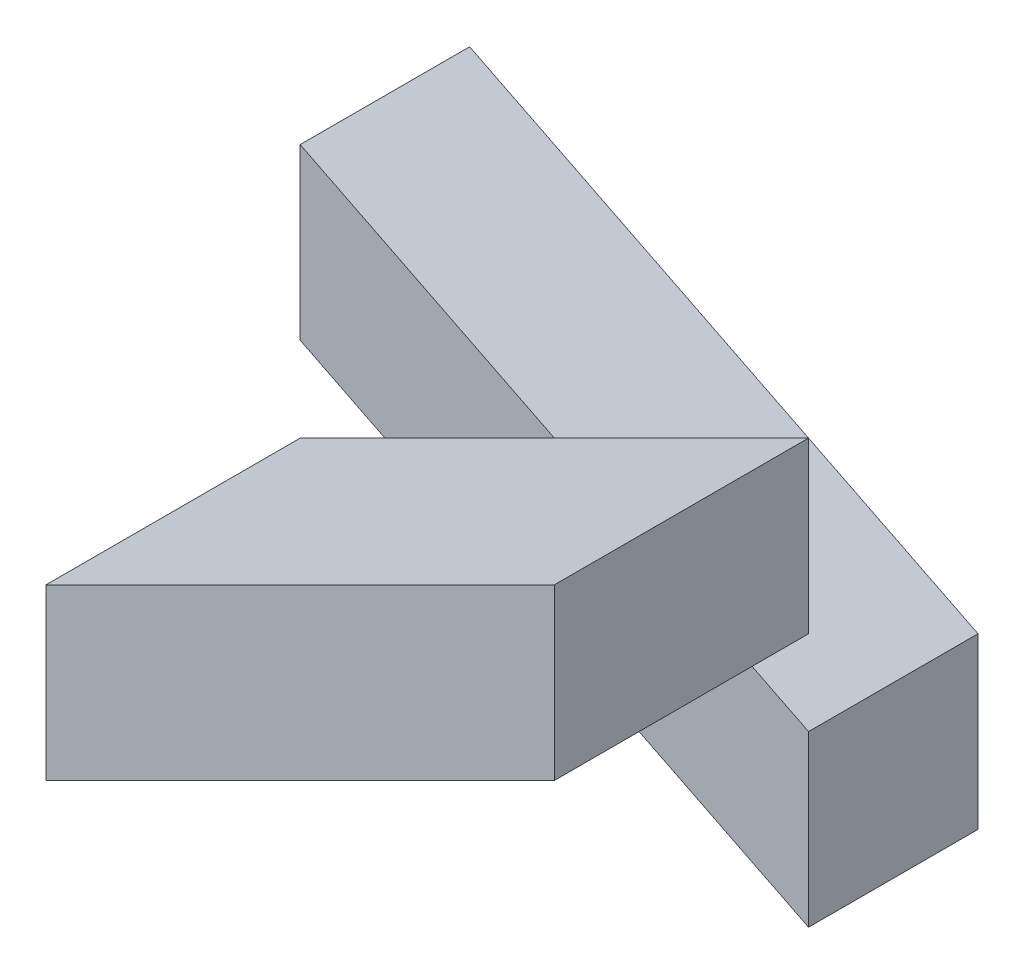
ISO-10303-21;
HEADER;
FILE_DESCRIPTION(('STEP AP214'),'2;1');
FILE_NAME('part.step','',(''),(''),'','','');
FILE_SCHEMA(('AUTOMOTIVE_DESIGN { 1 0 10303 214 1 1 1 1 }'));
ENDSEC;
DATA;
#1=APPLICATION_CONTEXT('core data for automotive mechanical design processes');
#2=APPLICATION_PROTOCOL_DEFINITION('international standard','automotive_design',2000,#1);
#3=PRODUCT_CONTEXT('',#1,'mechanical');
#4=PRODUCT('Part','Part','',(#3));
#5=PRODUCT_RELATED_PRODUCT_CATEGORY('part','',(#4));
#6=PRODUCT_DEFINITION_FORMATION('','',#4);
#7=PRODUCT_DEFINITION_CONTEXT('part definition',#1,'design');
#8=PRODUCT_DEFINITION('design','',#6,#7);
#9=PRODUCT_DEFINITION_SHAPE('','',#8);
#10=(LENGTH_UNIT() NAMED_UNIT(*) SI_UNIT(.MILLI.,.METRE.));
#11=(NAMED_UNIT(*) PLANE_ANGLE_UNIT() SI_UNIT($,.RADIAN.));
#12=(NAMED_UNIT(*) SI_UNIT($,.STERADIAN.) SOLID_ANGLE_UNIT());
#13=UNCERTAINTY_MEASURE_WITH_UNIT(LENGTH_MEASURE(1.E-05),#10,'distance_accuracy_value','');
#14=(GEOMETRIC_REPRESENTATION_CONTEXT(3) GLOBAL_UNCERTAINTY_ASSIGNED_CONTEXT((#13)) GLOBAL_UNIT_ASSIGNED_CONTEXT((#10,
#11,#12)) REPRESENTATION_CONTEXT('',''));
#15=CARTESIAN_POINT('',(0.,0.,0.));
#16=DIRECTION('',(0.,0.,1.));
#17=DIRECTION('',(1.,0.,0.));
#18=AXIS2_PLACEMENT_3D('',#15,#16,#17);
#19=CARTESIAN_POINT('',(0.,0.,10.));
#20=DIRECTION('',(0.,0.,1.));
#21=DIRECTION('',(1.,0.,0.));
#22=AXIS2_PLACEMENT_3D('',#19,#20,#21);
#23=PLANE('',#22);
#24=DIRECTION('',(-0.894427190999916,-0.447213595499958,0.));
#25=VECTOR('',#24,1.);
#26=CARTESIAN_POINT('',(-39.9082568807339,0.0917431192660537,10.));
#27=LINE('',#26,#25);
#28=CARTESIAN_POINT('',(-24.9082568807339,7.59174311926605,10.));
#29=VERTEX_POINT('',#28);
#30=CARTESIAN_POINT('',(-34.9082568807339,2.59174311926605,10.));
#31=VERTEX_POINT('',#30);
#32=EDGE_CURVE('E11',#29,#31,#27,.T.);
#33=ORIENTED_EDGE('',*,*,#32,.F.);
#34=DIRECTION('',(-0.894427190999916,0.447213595499958,0.));
#35=VECTOR('',#34,1.);
#36=CARTESIAN_POINT('',(-9.90825688073395,0.0917431192660537,10.));
#37=LINE('',#36,#35);
#38=CARTESIAN_POINT('',(-39.9082568807339,15.0917431192661,10.));
#39=VERTEX_POINT('',#38);
#40=EDGE_CURVE('E152',#29,#39,#37,.T.);
#41=ORIENTED_EDGE('',*,*,#40,.T.);
#42=DIRECTION('',(0.,-1.,0.));
#43=VECTOR('',#42,1.);
#44=CARTESIAN_POINT('',(-39.9082568807339,15.0917431192661,10.));
#45=LINE('',#44,#43);
#46=CARTESIAN_POINT('',(-39.9082568807339,5.09174311926605,10.));
#47=VERTEX_POINT('',#46);
#48=EDGE_CURVE('E150',#39,#47,#45,.T.);
#49=ORIENTED_EDGE('',*,*,#48,.T.);
#50=DIRECTION('',(0.894427190999916,-0.447213595499958,0.));
#51=VECTOR('',#50,1.);
#52=CARTESIAN_POINT('',(-39.9082568807339,5.09174311926605,10.));
#53=LINE('',#52,#51);
#54=EDGE_CURVE('E155',#47,#31,#53,.T.);
#55=ORIENTED_EDGE('',*,*,#54,.T.);
#56=EDGE_LOOP('',(#33,#41,#49,#55));
#57=FACE_BOUND('',#56,.T.);
#58=ADVANCED_FACE('F33',(#57),#23,.T.);
#59=CARTESIAN_POINT('',(-9.90825688073395,0.0917431192660537,10.));
#60=DIRECTION('',(-0.447213595499958,-0.894427190999916,0.));
#61=DIRECTION('',(0.894427190999916,-0.447213595499958,0.));
#62=AXIS2_PLACEMENT_3D('',#59,#60,#61);
#63=PLANE('',#62);
#64=DIRECTION('',(-0.894427190999916,0.447213595499958,0.));
#65=VECTOR('',#64,1.);
#66=CARTESIAN_POINT('',(-9.90825688073395,0.0917431192660537,0.));
#67=LINE('',#66,#65);
#68=CARTESIAN_POINT('',(-9.90825688073395,0.0917431192660537,0.));
#69=VERTEX_POINT('',#68);
#70=CARTESIAN_POINT('',(-39.9082568807339,15.0917431192661,0.));
#71=VERTEX_POINT('',#70);
#72=EDGE_CURVE('E139',#69,#71,#67,.T.);
#73=ORIENTED_EDGE('',*,*,#72,.T.);
#74=DIRECTION('',(0.,0.,-1.));
#75=VECTOR('',#74,1.);
#76=CARTESIAN_POINT('',(-39.9082568807339,15.0917431192661,10.));
#77=LINE('',#76,#75);
#78=EDGE_CURVE('E37',#39,#71,#77,.T.);
#79=ORIENTED_EDGE('',*,*,#78,.F.);
#80=ORIENTED_EDGE('',*,*,#40,.F.);
#81=CARTESIAN_POINT('',(-14.908256880734,2.59174311926606,10.));
#82=VERTEX_POINT('',#81);
#83=EDGE_CURVE('E151',#82,#29,#37,.T.);
#84=ORIENTED_EDGE('',*,*,#83,.F.);
#85=CARTESIAN_POINT('',(-9.90825688073395,0.0917431192660537,10.));
#86=VERTEX_POINT('',#85);
#87=EDGE_CURVE('E148',#86,#82,#37,.T.);
#88=ORIENTED_EDGE('',*,*,#87,.F.);
#89=DIRECTION('',(0.,0.,-1.));
#90=VECTOR('',#89,1.);
#91=CARTESIAN_POINT('',(-9.90825688073395,0.0917431192660537,10.));
#92=LINE('',#91,#90);
#93=EDGE_CURVE('E158',#86,#69,#92,.T.);
#94=ORIENTED_EDGE('',*,*,#93,.T.);
#95=EDGE_LOOP('',(#73,#79,#80,#84,#88,#94));
#96=FACE_BOUND('',#95,.T.);
#97=ADVANCED_FACE('F35',(#96),#63,.F.);
#98=CARTESIAN_POINT('',(-39.9082568807339,15.0917431192661,10.));
#99=DIRECTION('',(1.,0.,0.));
#100=DIRECTION('',(0.,1.,0.));
#101=AXIS2_PLACEMENT_3D('',#98,#99,#100);
#102=PLANE('',#101);
#103=DIRECTION('',(0.,-1.,0.));
#104=VECTOR('',#103,1.);
#105=CARTESIAN_POINT('',(-39.9082568807339,15.0917431192661,0.));
#106=LINE('',#105,#104);
#107=CARTESIAN_POINT('',(-39.9082568807339,5.09174311926605,0.));
#108=VERTEX_POINT('',#107);
#109=EDGE_CURVE('E142',#71,#108,#106,.T.);
#110=ORIENTED_EDGE('',*,*,#109,.T.);
#111=DIRECTION('',(0.,0.,-1.));
#112=VECTOR('',#111,1.);
#113=CARTESIAN_POINT('',(-39.9082568807339,5.09174311926605,10.));
#114=LINE('',#113,#112);
#115=EDGE_CURVE('E169',#47,#108,#114,.T.);
#116=ORIENTED_EDGE('',*,*,#115,.F.);
#117=ORIENTED_EDGE('',*,*,#48,.F.);
#118=ORIENTED_EDGE('',*,*,#78,.T.);
#119=EDGE_LOOP('',(#110,#116,#117,#118));
#120=FACE_BOUND('',#119,.T.);
#121=ADVANCED_FACE('F205',(#120),#102,.F.);
#122=CARTESIAN_POINT('',(-39.9082568807339,5.09174311926605,10.));
#123=DIRECTION('',(0.447213595499958,0.894427190999916,0.));
#124=DIRECTION('',(-0.894427190999916,0.447213595499958,0.));
#125=AXIS2_PLACEMENT_3D('',#122,#123,#124);
#126=PLANE('',#125);
#127=DIRECTION('',(0.894427190999916,-0.447213595499958,0.));
#128=VECTOR('',#127,1.);
#129=CARTESIAN_POINT('',(-39.9082568807339,5.09174311926605,0.));
#130=LINE('',#129,#128);
#131=CARTESIAN_POINT('',(-9.90825688073395,-9.90825688073395,0.));
#132=VERTEX_POINT('',#131);
#133=EDGE_CURVE('E161',#108,#132,#130,.T.);
#134=ORIENTED_EDGE('',*,*,#133,.T.);
#135=DIRECTION('',(0.,0.,-1.));
#136=VECTOR('',#135,1.);
#137=CARTESIAN_POINT('',(-9.90825688073395,-9.90825688073395,10.));
#138=LINE('',#137,#136);
#139=CARTESIAN_POINT('',(-9.90825688073395,-9.90825688073395,10.));
#140=VERTEX_POINT('',#139);
#141=EDGE_CURVE('E167',#140,#132,#138,.T.);
#142=ORIENTED_EDGE('',*,*,#141,.F.);
#143=CARTESIAN_POINT('',(-24.908256880734,-2.40825688073394,10.));
#144=VERTEX_POINT('',#143);
#145=EDGE_CURVE('E154',#144,#140,#53,.T.);
#146=ORIENTED_EDGE('',*,*,#145,.F.);
#147=EDGE_CURVE('E58',#31,#144,#53,.T.);
#148=ORIENTED_EDGE('',*,*,#147,.F.);
#149=ORIENTED_EDGE('',*,*,#54,.F.);
#150=ORIENTED_EDGE('',*,*,#115,.T.);
#151=EDGE_LOOP('',(#134,#142,#146,#148,#149,#150));
#152=FACE_BOUND('',#151,.T.);
#153=ADVANCED_FACE('F212',(#152),#126,.F.);
#154=CARTESIAN_POINT('',(-9.90825688073395,-9.90825688073395,10.));
#155=DIRECTION('',(-1.,0.,0.));
#156=DIRECTION('',(0.,0.,1.));
#157=AXIS2_PLACEMENT_3D('',#154,#155,#156);
#158=PLANE('',#157);
#159=DIRECTION('',(0.,1.,0.));
#160=VECTOR('',#159,1.);
#161=CARTESIAN_POINT('',(-9.90825688073395,-9.90825688073395,0.));
#162=LINE('',#161,#160);
#163=EDGE_CURVE('E163',#132,#69,#162,.T.);
#164=ORIENTED_EDGE('',*,*,#163,.T.);
#165=ORIENTED_EDGE('',*,*,#93,.F.);
#166=DIRECTION('',(0.,1.,0.));
#167=VECTOR('',#166,1.);
#168=CARTESIAN_POINT('',(-9.90825688073395,-9.90825688073395,10.));
#169=LINE('',#168,#167);
#170=EDGE_CURVE('E157',#140,#86,#169,.T.);
#171=ORIENTED_EDGE('',*,*,#170,.F.);
#172=ORIENTED_EDGE('',*,*,#141,.T.);
#173=EDGE_LOOP('',(#164,#165,#171,#172));
#174=FACE_BOUND('',#173,.T.);
#175=ADVANCED_FACE('F215',(#174),#158,.F.);
#176=DIRECTION('',(0.894427190999916,0.447213595499958,0.));
#177=VECTOR('',#176,1.);
#178=CARTESIAN_POINT('',(-9.90825688073395,5.09174311926606,10.));
#179=LINE('',#178,#177);
#180=EDGE_CURVE('E42',#144,#82,#179,.T.);
#181=ORIENTED_EDGE('',*,*,#180,.F.);
#182=ORIENTED_EDGE('',*,*,#145,.T.);
#183=ORIENTED_EDGE('',*,*,#170,.T.);
#184=ORIENTED_EDGE('',*,*,#87,.T.);
#185=EDGE_LOOP('',(#181,#182,#183,#184));
#186=FACE_BOUND('',#185,.T.);
#187=ADVANCED_FACE('F216',(#186),#23,.T.);
#188=CARTESIAN_POINT('',(0.,0.,0.));
#189=DIRECTION('',(0.,0.,1.));
#190=DIRECTION('',(1.,0.,0.));
#191=AXIS2_PLACEMENT_3D('',#188,#189,#190);
#192=PLANE('',#191);
#193=ORIENTED_EDGE('',*,*,#72,.F.);
#194=ORIENTED_EDGE('',*,*,#163,.F.);
#195=ORIENTED_EDGE('',*,*,#133,.F.);
#196=ORIENTED_EDGE('',*,*,#109,.F.);
#197=EDGE_LOOP('',(#193,#194,#195,#196));
#198=FACE_BOUND('',#197,.T.);
#199=ADVANCED_FACE('F210',(#198),#192,.F.);
#200=CARTESIAN_POINT('',(0.,0.,10.));
#201=DIRECTION('',(0.,0.,-1.));
#202=DIRECTION('',(-1.,0.,0.));
#203=AXIS2_PLACEMENT_3D('',#200,#201,#202);
#204=PLANE('',#203);
#205=CARTESIAN_POINT('',(-9.90825688073395,5.09174311926606,10.));
#206=VERTEX_POINT('',#205);
#207=EDGE_CURVE('E179',#82,#206,#179,.T.);
#208=ORIENTED_EDGE('',*,*,#207,.F.);
#209=ORIENTED_EDGE('',*,*,#83,.T.);
#210=CARTESIAN_POINT('',(-9.90825688073395,15.0917431192661,10.));
#211=VERTEX_POINT('',#210);
#212=EDGE_CURVE('E44',#211,#29,#27,.T.);
#213=ORIENTED_EDGE('',*,*,#212,.F.);
#214=DIRECTION('',(0.,1.,0.));
#215=VECTOR('',#214,1.);
#216=CARTESIAN_POINT('',(-9.90825688073395,15.0917431192661,10.));
#217=LINE('',#216,#215);
#218=EDGE_CURVE('E133',#206,#211,#217,.T.);
#219=ORIENTED_EDGE('',*,*,#218,.F.);
#220=EDGE_LOOP('',(#208,#209,#213,#219));
#221=FACE_BOUND('',#220,.T.);
#222=ADVANCED_FACE('F199',(#221),#204,.T.);
#223=CARTESIAN_POINT('',(-39.9082568807339,0.0917431192660537,25.));
#224=DIRECTION('',(0.447213595499958,-0.894427190999916,0.));
#225=DIRECTION('',(0.894427190999916,0.447213595499958,0.));
#226=AXIS2_PLACEMENT_3D('',#223,#224,#225);
#227=PLANE('',#226);
#228=ORIENTED_EDGE('',*,*,#212,.T.);
#229=ORIENTED_EDGE('',*,*,#32,.T.);
#230=CARTESIAN_POINT('',(-39.9082568807339,0.0917431192660537,10.));
#231=VERTEX_POINT('',#230);
#232=EDGE_CURVE('E45',#31,#231,#27,.T.);
#233=ORIENTED_EDGE('',*,*,#232,.T.);
#234=DIRECTION('',(0.,0.,-1.));
#235=VECTOR('',#234,1.);
#236=CARTESIAN_POINT('',(-39.9082568807339,0.0917431192660537,25.));
#237=LINE('',#236,#235);
#238=CARTESIAN_POINT('',(-39.9082568807339,0.0917431192660537,25.));
#239=VERTEX_POINT('',#238);
#240=EDGE_CURVE('E118',#239,#231,#237,.T.);
#241=ORIENTED_EDGE('',*,*,#240,.F.);
#242=DIRECTION('',(-0.894427190999916,-0.447213595499958,0.));
#243=VECTOR('',#242,1.);
#244=CARTESIAN_POINT('',(-39.9082568807339,0.0917431192660537,25.));
#245=LINE('',#244,#243);
#246=CARTESIAN_POINT('',(-9.90825688073395,15.0917431192661,25.));
#247=VERTEX_POINT('',#246);
#248=EDGE_CURVE('E124',#247,#239,#245,.T.);
#249=ORIENTED_EDGE('',*,*,#248,.F.);
#250=DIRECTION('',(0.,0.,-1.));
#251=VECTOR('',#250,1.);
#252=CARTESIAN_POINT('',(-9.90825688073395,15.0917431192661,25.));
#253=LINE('',#252,#251);
#254=EDGE_CURVE('E190',#247,#211,#253,.T.);
#255=ORIENTED_EDGE('',*,*,#254,.T.);
#256=EDGE_LOOP('',(#228,#229,#233,#241,#249,#255));
#257=FACE_BOUND('',#256,.T.);
#258=ADVANCED_FACE('F136',(#257),#227,.F.);
#259=CARTESIAN_POINT('',(-39.9082568807339,-9.90825688073395,25.));
#260=DIRECTION('',(1.,0.,0.));
#261=DIRECTION('',(0.,0.,-1.));
#262=AXIS2_PLACEMENT_3D('',#259,#260,#261);
#263=PLANE('',#262);
#264=DIRECTION('',(0.,-1.,0.));
#265=VECTOR('',#264,1.);
#266=CARTESIAN_POINT('',(-39.9082568807339,-9.90825688073395,10.));
#267=LINE('',#266,#265);
#268=CARTESIAN_POINT('',(-39.9082568807339,-9.90825688073395,10.));
#269=VERTEX_POINT('',#268);
#270=EDGE_CURVE('E184',#231,#269,#267,.T.);
#271=ORIENTED_EDGE('',*,*,#270,.T.);
#272=DIRECTION('',(0.,0.,-1.));
#273=VECTOR('',#272,1.);
#274=CARTESIAN_POINT('',(-39.9082568807339,-9.90825688073395,25.));
#275=LINE('',#274,#273);
#276=CARTESIAN_POINT('',(-39.9082568807339,-9.90825688073395,25.));
#277=VERTEX_POINT('',#276);
#278=EDGE_CURVE('E120',#277,#269,#275,.T.);
#279=ORIENTED_EDGE('',*,*,#278,.F.);
#280=DIRECTION('',(0.,-1.,0.));
#281=VECTOR('',#280,1.);
#282=CARTESIAN_POINT('',(-39.9082568807339,-9.90825688073395,25.));
#283=LINE('',#282,#281);
#284=EDGE_CURVE('E114',#239,#277,#283,.T.);
#285=ORIENTED_EDGE('',*,*,#284,.F.);
#286=ORIENTED_EDGE('',*,*,#240,.T.);
#287=EDGE_LOOP('',(#271,#279,#285,#286));
#288=FACE_BOUND('',#287,.T.);
#289=ADVANCED_FACE('F116',(#288),#263,.F.);
#290=CARTESIAN_POINT('',(-9.90825688073395,5.09174311926606,25.));
#291=DIRECTION('',(-0.447213595499958,0.894427190999916,0.));
#292=DIRECTION('',(-0.894427190999916,-0.447213595499958,0.));
#293=AXIS2_PLACEMENT_3D('',#290,#291,#292);
#294=PLANE('',#293);
#295=EDGE_CURVE('E178',#269,#144,#179,.T.);
#296=ORIENTED_EDGE('',*,*,#295,.T.);
#297=ORIENTED_EDGE('',*,*,#180,.T.);
#298=ORIENTED_EDGE('',*,*,#207,.T.);
#299=DIRECTION('',(0.,0.,-1.));
#300=VECTOR('',#299,1.);
#301=CARTESIAN_POINT('',(-9.90825688073395,5.09174311926606,25.));
#302=LINE('',#301,#300);
#303=CARTESIAN_POINT('',(-9.90825688073395,5.09174311926606,25.));
#304=VERTEX_POINT('',#303);
#305=EDGE_CURVE('E144',#304,#206,#302,.T.);
#306=ORIENTED_EDGE('',*,*,#305,.F.);
#307=DIRECTION('',(0.894427190999916,0.447213595499958,0.));
#308=VECTOR('',#307,1.);
#309=CARTESIAN_POINT('',(-9.90825688073395,5.09174311926606,25.));
#310=LINE('',#309,#308);
#311=EDGE_CURVE('E123',#277,#304,#310,.T.);
#312=ORIENTED_EDGE('',*,*,#311,.F.);
#313=ORIENTED_EDGE('',*,*,#278,.T.);
#314=EDGE_LOOP('',(#296,#297,#298,#306,#312,#313));
#315=FACE_BOUND('',#314,.T.);
#316=ADVANCED_FACE('F191',(#315),#294,.F.);
#317=CARTESIAN_POINT('',(-9.90825688073395,15.0917431192661,25.));
#318=DIRECTION('',(-1.,0.,0.));
#319=DIRECTION('',(0.,0.,1.));
#320=AXIS2_PLACEMENT_3D('',#317,#318,#319);
#321=PLANE('',#320);
#322=ORIENTED_EDGE('',*,*,#218,.T.);
#323=ORIENTED_EDGE('',*,*,#254,.F.);
#324=DIRECTION('',(0.,1.,0.));
#325=VECTOR('',#324,1.);
#326=CARTESIAN_POINT('',(-9.90825688073395,15.0917431192661,25.));
#327=LINE('',#326,#325);
#328=EDGE_CURVE('E129',#304,#247,#327,.T.);
#329=ORIENTED_EDGE('',*,*,#328,.F.);
#330=ORIENTED_EDGE('',*,*,#305,.T.);
#331=EDGE_LOOP('',(#322,#323,#329,#330));
#332=FACE_BOUND('',#331,.T.);
#333=ADVANCED_FACE('F194',(#332),#321,.F.);
#334=CARTESIAN_POINT('',(0.,0.,25.));
#335=DIRECTION('',(0.,0.,-1.));
#336=DIRECTION('',(-1.,0.,0.));
#337=AXIS2_PLACEMENT_3D('',#334,#335,#336);
#338=PLANE('',#337);
#339=ORIENTED_EDGE('',*,*,#248,.T.);
#340=ORIENTED_EDGE('',*,*,#284,.T.);
#341=ORIENTED_EDGE('',*,*,#311,.T.);
#342=ORIENTED_EDGE('',*,*,#328,.T.);
#343=EDGE_LOOP('',(#339,#340,#341,#342));
#344=FACE_BOUND('',#343,.T.);
#345=ADVANCED_FACE('F127',(#344),#338,.F.);
#346=ORIENTED_EDGE('',*,*,#232,.F.);
#347=ORIENTED_EDGE('',*,*,#147,.T.);
#348=ORIENTED_EDGE('',*,*,#295,.F.);
#349=ORIENTED_EDGE('',*,*,#270,.F.);
#350=EDGE_LOOP('',(#346,#347,#348,#349));
#351=FACE_BOUND('',#350,.T.);
#352=ADVANCED_FACE('F219',(#351),#204,.T.);
#353=CLOSED_SHELL('',(#58,#97,#121,#153,#175,#187,#199,#222,#258,#289,#316,#333,#345,#352));
#354=MANIFOLD_SOLID_BREP('B2',#353);
#355=ADVANCED_BREP_SHAPE_REPRESENTATION('',(#18,#354),#14);
#356=SHAPE_DEFINITION_REPRESENTATION(#9,#355);
ENDSEC;
END-ISO-10303-21;
